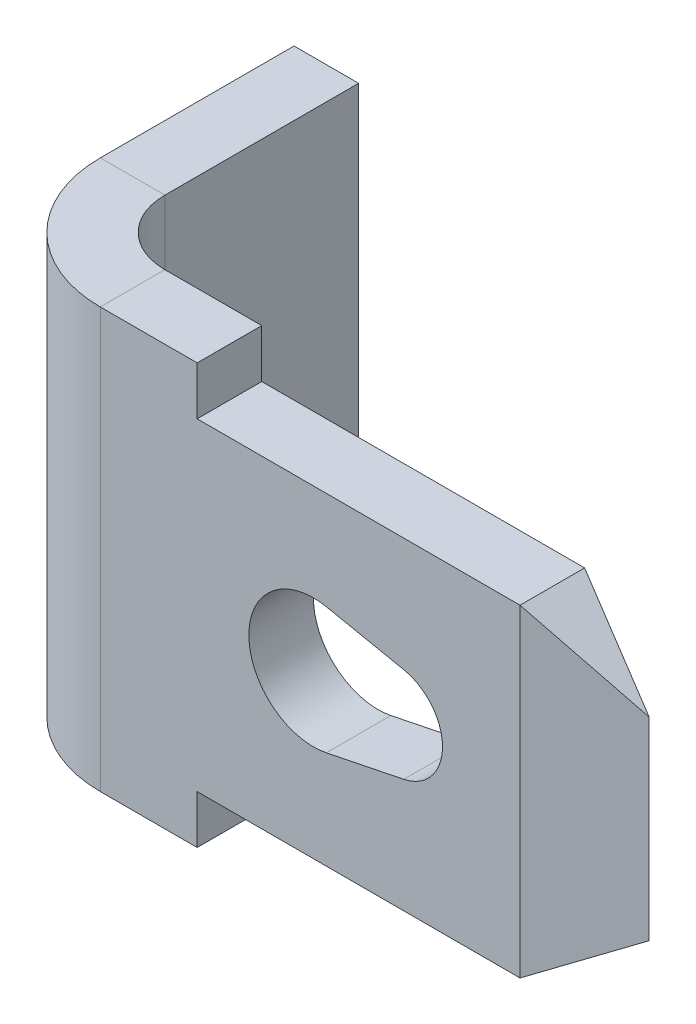
ISO-10303-21;
HEADER;
FILE_DESCRIPTION(('STEP AP214'),'2;1');
FILE_NAME('part.step','',(''),(''),'','','');
FILE_SCHEMA(('AUTOMOTIVE_DESIGN { 1 0 10303 214 1 1 1 1 }'));
ENDSEC;
DATA;
#1=APPLICATION_CONTEXT('core data for automotive mechanical design processes');
#2=APPLICATION_PROTOCOL_DEFINITION('international standard','automotive_design',2000,#1);
#3=PRODUCT_CONTEXT('',#1,'mechanical');
#4=PRODUCT('Part','Part','',(#3));
#5=PRODUCT_RELATED_PRODUCT_CATEGORY('part','',(#4));
#6=PRODUCT_DEFINITION_FORMATION('','',#4);
#7=PRODUCT_DEFINITION_CONTEXT('part definition',#1,'design');
#8=PRODUCT_DEFINITION('design','',#6,#7);
#9=PRODUCT_DEFINITION_SHAPE('','',#8);
#10=(LENGTH_UNIT() NAMED_UNIT(*) SI_UNIT(.MILLI.,.METRE.));
#11=(NAMED_UNIT(*) PLANE_ANGLE_UNIT() SI_UNIT($,.RADIAN.));
#12=(NAMED_UNIT(*) SI_UNIT($,.STERADIAN.) SOLID_ANGLE_UNIT());
#13=UNCERTAINTY_MEASURE_WITH_UNIT(LENGTH_MEASURE(1.E-05),#10,'distance_accuracy_value','');
#14=(GEOMETRIC_REPRESENTATION_CONTEXT(3) GLOBAL_UNCERTAINTY_ASSIGNED_CONTEXT((#13)) GLOBAL_UNIT_ASSIGNED_CONTEXT((#10,
#11,#12)) REPRESENTATION_CONTEXT('',''));
#15=CARTESIAN_POINT('',(0.,0.,0.));
#16=DIRECTION('',(0.,0.,1.));
#17=DIRECTION('',(1.,0.,0.));
#18=AXIS2_PLACEMENT_3D('',#15,#16,#17);
#19=CARTESIAN_POINT('',(7.55,0.,0.));
#20=DIRECTION('',(0.,0.,-1.));
#21=DIRECTION('',(-1.,0.,0.));
#22=AXIS2_PLACEMENT_3D('',#19,#20,#21);
#23=CYLINDRICAL_SURFACE('',#22,0.75);
#24=DIRECTION('',(0.,0.,-1.));
#25=VECTOR('',#24,1.);
#26=CARTESIAN_POINT('',(7.7,-0.734846922834954,0.));
#27=LINE('',#26,#25);
#28=CARTESIAN_POINT('',(7.7,-0.734846922834953,1.));
#29=VERTEX_POINT('',#28);
#30=CARTESIAN_POINT('',(7.7,-0.734846922834954,0.));
#31=VERTEX_POINT('',#30);
#32=EDGE_CURVE('E12',#29,#31,#27,.T.);
#33=ORIENTED_EDGE('',*,*,#32,.F.);
#34=CARTESIAN_POINT('',(7.55,0.,0.999999999999999));
#35=DIRECTION('',(0.,0.,-1.));
#36=DIRECTION('',(-1.,0.,0.));
#37=AXIS2_PLACEMENT_3D('',#34,#35,#36);
#38=CIRCLE('',#37,0.75);
#39=CARTESIAN_POINT('',(7.7,0.734846922834953,1.));
#40=VERTEX_POINT('',#39);
#41=EDGE_CURVE('E146',#29,#40,#38,.F.);
#42=ORIENTED_EDGE('',*,*,#41,.T.);
#43=DIRECTION('',(0.,0.,-1.));
#44=VECTOR('',#43,1.);
#45=CARTESIAN_POINT('',(7.7,0.734846922834953,0.));
#46=LINE('',#45,#44);
#47=CARTESIAN_POINT('',(7.7,0.734846922834953,0.));
#48=VERTEX_POINT('',#47);
#49=EDGE_CURVE('E67',#40,#48,#46,.T.);
#50=ORIENTED_EDGE('',*,*,#49,.T.);
#51=CARTESIAN_POINT('',(7.55,0.,0.));
#52=DIRECTION('',(0.,0.,-1.));
#53=DIRECTION('',(-1.,0.,0.));
#54=AXIS2_PLACEMENT_3D('',#51,#52,#53);
#55=CIRCLE('',#54,0.75);
#56=EDGE_CURVE('E201',#31,#48,#55,.F.);
#57=ORIENTED_EDGE('',*,*,#56,.F.);
#58=EDGE_LOOP('',(#33,#42,#50,#57));
#59=FACE_BOUND('',#58,.T.);
#60=ADVANCED_FACE('F57',(#59),#23,.F.);
#61=CARTESIAN_POINT('',(6.5,0.979795897113271,0.));
#62=DIRECTION('',(-0.2,-0.979795897113271,0.));
#63=DIRECTION('',(-0.979795897113271,0.2,0.));
#64=AXIS2_PLACEMENT_3D('',#61,#62,#63);
#65=PLANE('',#64);
#66=ORIENTED_EDGE('',*,*,#49,.F.);
#67=DIRECTION('',(-0.979795897113271,0.2,0.));
#68=VECTOR('',#67,1.);
#69=CARTESIAN_POINT('',(6.5,0.979795897113271,0.999999999999999));
#70=LINE('',#69,#68);
#71=CARTESIAN_POINT('',(6.5,0.97979589711327,1.));
#72=VERTEX_POINT('',#71);
#73=EDGE_CURVE('E159',#40,#72,#70,.T.);
#74=ORIENTED_EDGE('',*,*,#73,.T.);
#75=DIRECTION('',(0.,0.,-1.));
#76=VECTOR('',#75,1.);
#77=CARTESIAN_POINT('',(6.5,0.979795897113271,0.));
#78=LINE('',#77,#76);
#79=CARTESIAN_POINT('',(6.5,0.979795897113271,0.));
#80=VERTEX_POINT('',#79);
#81=EDGE_CURVE('E138',#72,#80,#78,.T.);
#82=ORIENTED_EDGE('',*,*,#81,.T.);
#83=DIRECTION('',(-0.979795897113271,0.2,0.));
#84=VECTOR('',#83,1.);
#85=CARTESIAN_POINT('',(6.5,0.979795897113271,0.));
#86=LINE('',#85,#84);
#87=EDGE_CURVE('E209',#48,#80,#86,.T.);
#88=ORIENTED_EDGE('',*,*,#87,.F.);
#89=EDGE_LOOP('',(#66,#74,#82,#88));
#90=FACE_BOUND('',#89,.T.);
#91=ADVANCED_FACE('F211',(#90),#65,.T.);
#92=CARTESIAN_POINT('',(6.3,0.,0.));
#93=DIRECTION('',(0.,0.,-1.));
#94=DIRECTION('',(-1.,0.,0.));
#95=AXIS2_PLACEMENT_3D('',#92,#93,#94);
#96=CYLINDRICAL_SURFACE('',#95,1.);
#97=ORIENTED_EDGE('',*,*,#81,.F.);
#98=CARTESIAN_POINT('',(6.3,0.,0.999999999999999));
#99=DIRECTION('',(0.,0.,-1.));
#100=DIRECTION('',(-1.,0.,0.));
#101=AXIS2_PLACEMENT_3D('',#98,#99,#100);
#102=CIRCLE('',#101,1.);
#103=CARTESIAN_POINT('',(6.5,-0.979795897113271,1.));
#104=VERTEX_POINT('',#103);
#105=EDGE_CURVE('E144',#72,#104,#102,.F.);
#106=ORIENTED_EDGE('',*,*,#105,.T.);
#107=DIRECTION('',(0.,0.,-1.));
#108=VECTOR('',#107,1.);
#109=CARTESIAN_POINT('',(6.5,-0.979795897113272,0.));
#110=LINE('',#109,#108);
#111=CARTESIAN_POINT('',(6.5,-0.979795897113272,0.));
#112=VERTEX_POINT('',#111);
#113=EDGE_CURVE('E61',#104,#112,#110,.T.);
#114=ORIENTED_EDGE('',*,*,#113,.T.);
#115=CARTESIAN_POINT('',(6.3,0.,0.));
#116=DIRECTION('',(0.,0.,-1.));
#117=DIRECTION('',(-1.,0.,0.));
#118=AXIS2_PLACEMENT_3D('',#115,#116,#117);
#119=CIRCLE('',#118,1.);
#120=EDGE_CURVE('E309',#80,#112,#119,.F.);
#121=ORIENTED_EDGE('',*,*,#120,.F.);
#122=EDGE_LOOP('',(#97,#106,#114,#121));
#123=FACE_BOUND('',#122,.T.);
#124=ADVANCED_FACE('F148',(#123),#96,.F.);
#125=CARTESIAN_POINT('',(2.,-3.25,-4.));
#126=DIRECTION('',(0.,-1.,0.));
#127=DIRECTION('',(0.,0.,1.));
#128=AXIS2_PLACEMENT_3D('',#125,#126,#127);
#129=PLANE('',#128);
#130=DIRECTION('',(1.,0.,0.));
#131=VECTOR('',#130,1.);
#132=CARTESIAN_POINT('',(2.,-3.25,-1.));
#133=LINE('',#132,#131);
#134=CARTESIAN_POINT('',(0.999999999999999,-3.25,-1.));
#135=VERTEX_POINT('',#134);
#136=CARTESIAN_POINT('',(2.,-3.25,-1.));
#137=VERTEX_POINT('',#136);
#138=EDGE_CURVE('E139',#135,#137,#133,.T.);
#139=ORIENTED_EDGE('',*,*,#138,.F.);
#140=DIRECTION('',(0.,0.,1.));
#141=VECTOR('',#140,1.);
#142=CARTESIAN_POINT('',(0.999999999999999,-3.25,-4.));
#143=LINE('',#142,#141);
#144=CARTESIAN_POINT('',(0.999999999999999,-3.25,-4.));
#145=VERTEX_POINT('',#144);
#146=EDGE_CURVE('E250',#145,#135,#143,.T.);
#147=ORIENTED_EDGE('',*,*,#146,.F.);
#148=DIRECTION('',(1.,0.,0.));
#149=VECTOR('',#148,1.);
#150=CARTESIAN_POINT('',(2.,-3.25,-4.));
#151=LINE('',#150,#149);
#152=CARTESIAN_POINT('',(2.,-3.25,-4.));
#153=VERTEX_POINT('',#152);
#154=EDGE_CURVE('E189',#145,#153,#151,.T.);
#155=ORIENTED_EDGE('',*,*,#154,.T.);
#156=DIRECTION('',(0.,0.,1.));
#157=VECTOR('',#156,1.);
#158=CARTESIAN_POINT('',(2.,-3.25,-4.));
#159=LINE('',#158,#157);
#160=EDGE_CURVE('E227',#153,#137,#159,.T.);
#161=ORIENTED_EDGE('',*,*,#160,.T.);
#162=EDGE_LOOP('',(#139,#147,#155,#161));
#163=FACE_BOUND('',#162,.T.);
#164=ADVANCED_FACE('F331',(#163),#129,.T.);
#165=CARTESIAN_POINT('',(2.,-3.25,-4.));
#166=DIRECTION('',(0.,0.,-1.));
#167=DIRECTION('',(0.,-1.,0.));
#168=AXIS2_PLACEMENT_3D('',#165,#166,#167);
#169=PLANE('',#168);
#170=ORIENTED_EDGE('',*,*,#154,.F.);
#171=DIRECTION('',(0.,1.,0.));
#172=VECTOR('',#171,1.);
#173=CARTESIAN_POINT('',(0.999999999999999,-3.25,-4.));
#174=LINE('',#173,#172);
#175=CARTESIAN_POINT('',(0.999999999999999,3.25,-4.));
#176=VERTEX_POINT('',#175);
#177=EDGE_CURVE('E253',#176,#145,#174,.F.);
#178=ORIENTED_EDGE('',*,*,#177,.F.);
#179=DIRECTION('',(1.,0.,0.));
#180=VECTOR('',#179,1.);
#181=CARTESIAN_POINT('',(2.,3.25,-4.));
#182=LINE('',#181,#180);
#183=CARTESIAN_POINT('',(2.,3.25,-4.));
#184=VERTEX_POINT('',#183);
#185=EDGE_CURVE('E186',#176,#184,#182,.T.);
#186=ORIENTED_EDGE('',*,*,#185,.T.);
#187=DIRECTION('',(0.,-1.,0.));
#188=VECTOR('',#187,1.);
#189=CARTESIAN_POINT('',(2.,-3.25,-4.));
#190=LINE('',#189,#188);
#191=EDGE_CURVE('E286',#184,#153,#190,.T.);
#192=ORIENTED_EDGE('',*,*,#191,.T.);
#193=EDGE_LOOP('',(#170,#178,#186,#192));
#194=FACE_BOUND('',#193,.T.);
#195=ADVANCED_FACE('F334',(#194),#169,.T.);
#196=CARTESIAN_POINT('',(2.,3.25,-4.));
#197=DIRECTION('',(0.,-1.,0.));
#198=DIRECTION('',(0.,0.,1.));
#199=AXIS2_PLACEMENT_3D('',#196,#197,#198);
#200=PLANE('',#199);
#201=ORIENTED_EDGE('',*,*,#185,.F.);
#202=DIRECTION('',(0.,0.,1.));
#203=VECTOR('',#202,1.);
#204=CARTESIAN_POINT('',(0.999999999999999,3.25,-4.));
#205=LINE('',#204,#203);
#206=CARTESIAN_POINT('',(0.999999999999999,3.25,-1.));
#207=VERTEX_POINT('',#206);
#208=EDGE_CURVE('E246',#176,#207,#205,.T.);
#209=ORIENTED_EDGE('',*,*,#208,.T.);
#210=DIRECTION('',(1.,0.,0.));
#211=VECTOR('',#210,1.);
#212=CARTESIAN_POINT('',(2.,3.25,-1.));
#213=LINE('',#212,#211);
#214=CARTESIAN_POINT('',(2.,3.25,-1.));
#215=VERTEX_POINT('',#214);
#216=EDGE_CURVE('E183',#207,#215,#213,.T.);
#217=ORIENTED_EDGE('',*,*,#216,.T.);
#218=DIRECTION('',(0.,0.,1.));
#219=VECTOR('',#218,1.);
#220=CARTESIAN_POINT('',(2.,3.25,-4.));
#221=LINE('',#220,#219);
#222=EDGE_CURVE('E289',#184,#215,#221,.T.);
#223=ORIENTED_EDGE('',*,*,#222,.F.);
#224=EDGE_LOOP('',(#201,#209,#217,#223));
#225=FACE_BOUND('',#224,.T.);
#226=ADVANCED_FACE('F317',(#225),#200,.F.);
#227=CARTESIAN_POINT('',(3.,3.25,-1.));
#228=DIRECTION('',(0.,-1.,0.));
#229=DIRECTION('',(0.,0.,-1.));
#230=AXIS2_PLACEMENT_3D('',#227,#228,#229);
#231=PLANE('',#230);
#232=ORIENTED_EDGE('',*,*,#216,.F.);
#233=CARTESIAN_POINT('',(3.,3.25,-1.));
#234=DIRECTION('',(0.,-1.,0.));
#235=DIRECTION('',(0.,0.,-1.));
#236=AXIS2_PLACEMENT_3D('',#233,#234,#235);
#237=CIRCLE('',#236,2.);
#238=CARTESIAN_POINT('',(3.,3.25,1.));
#239=VERTEX_POINT('',#238);
#240=EDGE_CURVE('E247',#207,#239,#237,.F.);
#241=ORIENTED_EDGE('',*,*,#240,.T.);
#242=DIRECTION('',(0.,0.,-1.));
#243=VECTOR('',#242,1.);
#244=CARTESIAN_POINT('',(3.,3.25,0.));
#245=LINE('',#244,#243);
#246=CARTESIAN_POINT('',(3.,3.25,0.));
#247=VERTEX_POINT('',#246);
#248=EDGE_CURVE('E181',#239,#247,#245,.T.);
#249=ORIENTED_EDGE('',*,*,#248,.T.);
#250=CARTESIAN_POINT('',(3.,3.25,-1.));
#251=DIRECTION('',(0.,1.,0.));
#252=DIRECTION('',(0.,0.,1.));
#253=AXIS2_PLACEMENT_3D('',#250,#251,#252);
#254=CIRCLE('',#253,1.);
#255=EDGE_CURVE('E223',#215,#247,#254,.T.);
#256=ORIENTED_EDGE('',*,*,#255,.F.);
#257=EDGE_LOOP('',(#232,#241,#249,#256));
#258=FACE_BOUND('',#257,.T.);
#259=ADVANCED_FACE('F326',(#258),#231,.F.);
#260=CARTESIAN_POINT('',(0.,3.25,0.));
#261=DIRECTION('',(0.,-1.,0.));
#262=DIRECTION('',(-1.,0.,0.));
#263=AXIS2_PLACEMENT_3D('',#260,#261,#262);
#264=PLANE('',#263);
#265=ORIENTED_EDGE('',*,*,#248,.F.);
#266=DIRECTION('',(-1.,0.,0.));
#267=VECTOR('',#266,1.);
#268=CARTESIAN_POINT('',(0.,3.25,1.));
#269=LINE('',#268,#267);
#270=CARTESIAN_POINT('',(4.5,3.25,1.));
#271=VERTEX_POINT('',#270);
#272=EDGE_CURVE('E243',#271,#239,#269,.T.);
#273=ORIENTED_EDGE('',*,*,#272,.F.);
#274=DIRECTION('',(0.,0.,-1.));
#275=VECTOR('',#274,1.);
#276=CARTESIAN_POINT('',(4.5,3.25,0.));
#277=LINE('',#276,#275);
#278=CARTESIAN_POINT('',(4.5,3.25,0.));
#279=VERTEX_POINT('',#278);
#280=EDGE_CURVE('E178',#271,#279,#277,.T.);
#281=ORIENTED_EDGE('',*,*,#280,.T.);
#282=DIRECTION('',(-1.,0.,0.));
#283=VECTOR('',#282,1.);
#284=CARTESIAN_POINT('',(0.,3.25,0.));
#285=LINE('',#284,#283);
#286=EDGE_CURVE('E292',#279,#247,#285,.T.);
#287=ORIENTED_EDGE('',*,*,#286,.T.);
#288=EDGE_LOOP('',(#265,#273,#281,#287));
#289=FACE_BOUND('',#288,.T.);
#290=ADVANCED_FACE('F380',(#289),#264,.F.);
#291=CARTESIAN_POINT('',(4.5,3.25,0.));
#292=DIRECTION('',(-1.,0.,0.));
#293=DIRECTION('',(0.,1.,0.));
#294=AXIS2_PLACEMENT_3D('',#291,#292,#293);
#295=PLANE('',#294);
#296=ORIENTED_EDGE('',*,*,#280,.F.);
#297=DIRECTION('',(0.,1.,0.));
#298=VECTOR('',#297,1.);
#299=CARTESIAN_POINT('',(4.5,0.,1.));
#300=LINE('',#299,#298);
#301=CARTESIAN_POINT('',(4.5,2.5,1.));
#302=VERTEX_POINT('',#301);
#303=EDGE_CURVE('E240',#302,#271,#300,.T.);
#304=ORIENTED_EDGE('',*,*,#303,.F.);
#305=DIRECTION('',(0.,0.,-1.));
#306=VECTOR('',#305,1.);
#307=CARTESIAN_POINT('',(4.5,2.5,0.));
#308=LINE('',#307,#306);
#309=CARTESIAN_POINT('',(4.5,2.5,0.));
#310=VERTEX_POINT('',#309);
#311=EDGE_CURVE('E175',#302,#310,#308,.T.);
#312=ORIENTED_EDGE('',*,*,#311,.T.);
#313=DIRECTION('',(0.,1.,0.));
#314=VECTOR('',#313,1.);
#315=CARTESIAN_POINT('',(4.5,3.25,0.));
#316=LINE('',#315,#314);
#317=EDGE_CURVE('E295',#310,#279,#316,.T.);
#318=ORIENTED_EDGE('',*,*,#317,.T.);
#319=EDGE_LOOP('',(#296,#304,#312,#318));
#320=FACE_BOUND('',#319,.T.);
#321=ADVANCED_FACE('F383',(#320),#295,.F.);
#322=CARTESIAN_POINT('',(4.5,2.5,0.));
#323=DIRECTION('',(0.,-1.,0.));
#324=DIRECTION('',(-1.,0.,0.));
#325=AXIS2_PLACEMENT_3D('',#322,#323,#324);
#326=PLANE('',#325);
#327=ORIENTED_EDGE('',*,*,#311,.F.);
#328=DIRECTION('',(-1.,0.,0.));
#329=VECTOR('',#328,1.);
#330=CARTESIAN_POINT('',(0.,2.5,1.));
#331=LINE('',#330,#329);
#332=CARTESIAN_POINT('',(9.5,2.5,1.));
#333=VERTEX_POINT('',#332);
#334=EDGE_CURVE('E237',#333,#302,#331,.T.);
#335=ORIENTED_EDGE('',*,*,#334,.F.);
#336=DIRECTION('',(0.,0.,-1.));
#337=VECTOR('',#336,1.);
#338=CARTESIAN_POINT('',(9.5,2.5,0.));
#339=LINE('',#338,#337);
#340=CARTESIAN_POINT('',(9.5,2.5,0.));
#341=VERTEX_POINT('',#340);
#342=EDGE_CURVE('E172',#333,#341,#339,.T.);
#343=ORIENTED_EDGE('',*,*,#342,.T.);
#344=DIRECTION('',(-1.,0.,0.));
#345=VECTOR('',#344,1.);
#346=CARTESIAN_POINT('',(4.5,2.5,0.));
#347=LINE('',#346,#345);
#348=EDGE_CURVE('E298',#341,#310,#347,.T.);
#349=ORIENTED_EDGE('',*,*,#348,.T.);
#350=EDGE_LOOP('',(#327,#335,#343,#349));
#351=FACE_BOUND('',#350,.T.);
#352=ADVANCED_FACE('F387',(#351),#326,.F.);
#353=CARTESIAN_POINT('',(9.5,2.5,0.));
#354=DIRECTION('',(-0.554700196225229,-0.832050294337844,0.));
#355=DIRECTION('',(-0.832050294337844,0.554700196225229,0.));
#356=AXIS2_PLACEMENT_3D('',#353,#354,#355);
#357=PLANE('',#356);
#358=DIRECTION('',(-0.801783725737273,0.534522483824849,0.267261241912424));
#359=VECTOR('',#358,1.);
#360=CARTESIAN_POINT('',(3.28528571428572,6.64314285714286,3.07157142857143));
#361=LINE('',#360,#359);
#362=CARTESIAN_POINT('',(11.,1.5,0.500000000000001));
#363=VERTEX_POINT('',#362);
#364=EDGE_CURVE('E446',#333,#363,#361,.F.);
#365=ORIENTED_EDGE('',*,*,#364,.T.);
#366=DIRECTION('',(0.801783725737273,-0.534522483824849,0.267261241912424));
#367=VECTOR('',#366,1.);
#368=CARTESIAN_POINT('',(3.071,6.786,-2.143));
#369=LINE('',#368,#367);
#370=EDGE_CURVE('E271',#363,#341,#369,.F.);
#371=ORIENTED_EDGE('',*,*,#370,.T.);
#372=ORIENTED_EDGE('',*,*,#342,.F.);
#373=EDGE_LOOP('',(#365,#371,#372));
#374=FACE_BOUND('',#373,.T.);
#375=ADVANCED_FACE('F391',(#374),#357,.F.);
#376=CARTESIAN_POINT('',(9.5,-2.5,0.));
#377=DIRECTION('',(-0.554700196225229,0.832050294337844,0.));
#378=DIRECTION('',(0.832050294337844,0.554700196225229,0.));
#379=AXIS2_PLACEMENT_3D('',#376,#377,#378);
#380=PLANE('',#379);
#381=DIRECTION('',(0.801783725737273,0.534522483824849,-0.267261241912424));
#382=VECTOR('',#381,1.);
#383=CARTESIAN_POINT('',(6.07185714285714,-4.78542857142857,2.14271428571429));
#384=LINE('',#383,#382);
#385=CARTESIAN_POINT('',(11.,-1.5,0.5));
#386=VERTEX_POINT('',#385);
#387=CARTESIAN_POINT('',(9.5,-2.5,1.));
#388=VERTEX_POINT('',#387);
#389=EDGE_CURVE('E444',#386,#388,#384,.F.);
#390=ORIENTED_EDGE('',*,*,#389,.T.);
#391=DIRECTION('',(0.,0.,-1.));
#392=VECTOR('',#391,1.);
#393=CARTESIAN_POINT('',(9.5,-2.5,0.));
#394=LINE('',#393,#392);
#395=CARTESIAN_POINT('',(9.5,-2.5,0.));
#396=VERTEX_POINT('',#395);
#397=EDGE_CURVE('E169',#388,#396,#394,.T.);
#398=ORIENTED_EDGE('',*,*,#397,.T.);
#399=DIRECTION('',(-0.801783725737273,-0.534522483824849,-0.267261241912424));
#400=VECTOR('',#399,1.);
#401=CARTESIAN_POINT('',(5.85757142857143,-4.92828571428571,-1.21414285714286));
#402=LINE('',#401,#400);
#403=EDGE_CURVE('E447',#396,#386,#402,.F.);
#404=ORIENTED_EDGE('',*,*,#403,.T.);
#405=EDGE_LOOP('',(#390,#398,#404));
#406=FACE_BOUND('',#405,.T.);
#407=ADVANCED_FACE('F395',(#406),#380,.F.);
#408=CARTESIAN_POINT('',(4.5,-2.5,0.));
#409=DIRECTION('',(0.,1.,0.));
#410=DIRECTION('',(1.,0.,0.));
#411=AXIS2_PLACEMENT_3D('',#408,#409,#410);
#412=PLANE('',#411);
#413=ORIENTED_EDGE('',*,*,#397,.F.);
#414=DIRECTION('',(-1.,0.,0.));
#415=VECTOR('',#414,1.);
#416=CARTESIAN_POINT('',(0.,-2.5,1.));
#417=LINE('',#416,#415);
#418=CARTESIAN_POINT('',(4.5,-2.5,1.));
#419=VERTEX_POINT('',#418);
#420=EDGE_CURVE('E234',#419,#388,#417,.F.);
#421=ORIENTED_EDGE('',*,*,#420,.F.);
#422=DIRECTION('',(0.,0.,-1.));
#423=VECTOR('',#422,1.);
#424=CARTESIAN_POINT('',(4.5,-2.5,0.));
#425=LINE('',#424,#423);
#426=CARTESIAN_POINT('',(4.5,-2.5,0.));
#427=VERTEX_POINT('',#426);
#428=EDGE_CURVE('E166',#419,#427,#425,.T.);
#429=ORIENTED_EDGE('',*,*,#428,.T.);
#430=DIRECTION('',(1.,0.,0.));
#431=VECTOR('',#430,1.);
#432=CARTESIAN_POINT('',(4.5,-2.5,0.));
#433=LINE('',#432,#431);
#434=EDGE_CURVE('E301',#427,#396,#433,.T.);
#435=ORIENTED_EDGE('',*,*,#434,.T.);
#436=EDGE_LOOP('',(#413,#421,#429,#435));
#437=FACE_BOUND('',#436,.T.);
#438=ADVANCED_FACE('F361',(#437),#412,.F.);
#439=CARTESIAN_POINT('',(4.5,-3.25,0.));
#440=DIRECTION('',(-1.,0.,0.));
#441=DIRECTION('',(0.,1.,0.));
#442=AXIS2_PLACEMENT_3D('',#439,#440,#441);
#443=PLANE('',#442);
#444=ORIENTED_EDGE('',*,*,#428,.F.);
#445=DIRECTION('',(0.,1.,0.));
#446=VECTOR('',#445,1.);
#447=CARTESIAN_POINT('',(4.5,0.,1.));
#448=LINE('',#447,#446);
#449=CARTESIAN_POINT('',(4.5,-3.25,1.));
#450=VERTEX_POINT('',#449);
#451=EDGE_CURVE('E153',#450,#419,#448,.T.);
#452=ORIENTED_EDGE('',*,*,#451,.F.);
#453=DIRECTION('',(0.,0.,-1.));
#454=VECTOR('',#453,1.);
#455=CARTESIAN_POINT('',(4.5,-3.25,0.));
#456=LINE('',#455,#454);
#457=CARTESIAN_POINT('',(4.5,-3.25,0.));
#458=VERTEX_POINT('',#457);
#459=EDGE_CURVE('E163',#450,#458,#456,.T.);
#460=ORIENTED_EDGE('',*,*,#459,.T.);
#461=DIRECTION('',(0.,1.,0.));
#462=VECTOR('',#461,1.);
#463=CARTESIAN_POINT('',(4.5,-3.25,0.));
#464=LINE('',#463,#462);
#465=EDGE_CURVE('E304',#458,#427,#464,.T.);
#466=ORIENTED_EDGE('',*,*,#465,.T.);
#467=EDGE_LOOP('',(#444,#452,#460,#466));
#468=FACE_BOUND('',#467,.T.);
#469=ADVANCED_FACE('F350',(#468),#443,.F.);
#470=CARTESIAN_POINT('',(0.,-3.25,0.));
#471=DIRECTION('',(0.,1.,0.));
#472=DIRECTION('',(1.,0.,0.));
#473=AXIS2_PLACEMENT_3D('',#470,#471,#472);
#474=PLANE('',#473);
#475=ORIENTED_EDGE('',*,*,#459,.F.);
#476=DIRECTION('',(-1.,0.,0.));
#477=VECTOR('',#476,1.);
#478=CARTESIAN_POINT('',(0.,-3.25,1.));
#479=LINE('',#478,#477);
#480=CARTESIAN_POINT('',(3.,-3.25,1.));
#481=VERTEX_POINT('',#480);
#482=EDGE_CURVE('E150',#481,#450,#479,.F.);
#483=ORIENTED_EDGE('',*,*,#482,.F.);
#484=DIRECTION('',(0.,0.,-1.));
#485=VECTOR('',#484,1.);
#486=CARTESIAN_POINT('',(3.,-3.25,0.));
#487=LINE('',#486,#485);
#488=CARTESIAN_POINT('',(3.,-3.25,0.));
#489=VERTEX_POINT('',#488);
#490=EDGE_CURVE('E75',#481,#489,#487,.T.);
#491=ORIENTED_EDGE('',*,*,#490,.T.);
#492=DIRECTION('',(1.,0.,0.));
#493=VECTOR('',#492,1.);
#494=CARTESIAN_POINT('',(0.,-3.25,0.));
#495=LINE('',#494,#493);
#496=EDGE_CURVE('E307',#489,#458,#495,.T.);
#497=ORIENTED_EDGE('',*,*,#496,.T.);
#498=EDGE_LOOP('',(#475,#483,#491,#497));
#499=FACE_BOUND('',#498,.T.);
#500=ADVANCED_FACE('F353',(#499),#474,.F.);
#501=CARTESIAN_POINT('',(3.,-3.25,-1.));
#502=DIRECTION('',(0.,-1.,0.));
#503=DIRECTION('',(0.,0.,-1.));
#504=AXIS2_PLACEMENT_3D('',#501,#502,#503);
#505=PLANE('',#504);
#506=CARTESIAN_POINT('',(3.,-3.25,-1.));
#507=DIRECTION('',(0.,-1.,0.));
#508=DIRECTION('',(0.,0.,-1.));
#509=AXIS2_PLACEMENT_3D('',#506,#507,#508);
#510=CIRCLE('',#509,2.);
#511=EDGE_CURVE('E157',#481,#135,#510,.T.);
#512=ORIENTED_EDGE('',*,*,#511,.T.);
#513=ORIENTED_EDGE('',*,*,#138,.T.);
#514=CARTESIAN_POINT('',(3.,-3.25,-1.));
#515=DIRECTION('',(0.,1.,0.));
#516=DIRECTION('',(0.,0.,1.));
#517=AXIS2_PLACEMENT_3D('',#514,#515,#516);
#518=CIRCLE('',#517,1.);
#519=EDGE_CURVE('E220',#489,#137,#518,.F.);
#520=ORIENTED_EDGE('',*,*,#519,.F.);
#521=ORIENTED_EDGE('',*,*,#490,.F.);
#522=EDGE_LOOP('',(#512,#513,#520,#521));
#523=FACE_BOUND('',#522,.T.);
#524=ADVANCED_FACE('F267',(#523),#505,.T.);
#525=CARTESIAN_POINT('',(6.5,-0.979795897113272,0.));
#526=DIRECTION('',(-0.2,0.979795897113271,0.));
#527=DIRECTION('',(0.979795897113271,0.2,0.));
#528=AXIS2_PLACEMENT_3D('',#525,#526,#527);
#529=PLANE('',#528);
#530=DIRECTION('',(0.979795897113271,0.2,0.));
#531=VECTOR('',#530,1.);
#532=CARTESIAN_POINT('',(6.5,-0.979795897113272,0.999999999999999));
#533=LINE('',#532,#531);
#534=EDGE_CURVE('E130',#104,#29,#533,.T.);
#535=ORIENTED_EDGE('',*,*,#534,.T.);
#536=ORIENTED_EDGE('',*,*,#32,.T.);
#537=DIRECTION('',(0.979795897113271,0.2,0.));
#538=VECTOR('',#537,1.);
#539=CARTESIAN_POINT('',(6.5,-0.979795897113272,0.));
#540=LINE('',#539,#538);
#541=EDGE_CURVE('E133',#112,#31,#540,.T.);
#542=ORIENTED_EDGE('',*,*,#541,.F.);
#543=ORIENTED_EDGE('',*,*,#113,.F.);
#544=EDGE_LOOP('',(#535,#536,#542,#543));
#545=FACE_BOUND('',#544,.T.);
#546=ADVANCED_FACE('F59',(#545),#529,.T.);
#547=CARTESIAN_POINT('',(0.,0.,0.));
#548=DIRECTION('',(0.,0.,-1.));
#549=DIRECTION('',(-1.,0.,0.));
#550=AXIS2_PLACEMENT_3D('',#547,#548,#549);
#551=PLANE('',#550);
#552=DIRECTION('',(0.,-1.,0.));
#553=VECTOR('',#552,1.);
#554=CARTESIAN_POINT('',(9.5,3.251,0.));
#555=LINE('',#554,#553);
#556=EDGE_CURVE('E273',#341,#396,#555,.T.);
#557=ORIENTED_EDGE('',*,*,#556,.T.);
#558=ORIENTED_EDGE('',*,*,#434,.F.);
#559=ORIENTED_EDGE('',*,*,#465,.F.);
#560=ORIENTED_EDGE('',*,*,#496,.F.);
#561=DIRECTION('',(0.,-1.,0.));
#562=VECTOR('',#561,1.);
#563=CARTESIAN_POINT('',(3.,0.,0.));
#564=LINE('',#563,#562);
#565=EDGE_CURVE('E195',#489,#247,#564,.F.);
#566=ORIENTED_EDGE('',*,*,#565,.T.);
#567=ORIENTED_EDGE('',*,*,#286,.F.);
#568=ORIENTED_EDGE('',*,*,#317,.F.);
#569=ORIENTED_EDGE('',*,*,#348,.F.);
#570=EDGE_LOOP('',(#557,#558,#559,#560,#566,#567,#568,#569));
#571=FACE_BOUND('',#570,.T.);
#572=ORIENTED_EDGE('',*,*,#120,.T.);
#573=ORIENTED_EDGE('',*,*,#541,.T.);
#574=ORIENTED_EDGE('',*,*,#56,.T.);
#575=ORIENTED_EDGE('',*,*,#87,.T.);
#576=EDGE_LOOP('',(#572,#573,#574,#575));
#577=FACE_BOUND('',#576,.T.);
#578=ADVANCED_FACE('F208',(#571,#577),#551,.T.);
#579=CARTESIAN_POINT('',(2.,-3.25,-4.));
#580=DIRECTION('',(-1.,0.,0.));
#581=DIRECTION('',(0.,0.,1.));
#582=AXIS2_PLACEMENT_3D('',#579,#580,#581);
#583=PLANE('',#582);
#584=ORIENTED_EDGE('',*,*,#222,.T.);
#585=DIRECTION('',(0.,-1.,0.));
#586=VECTOR('',#585,1.);
#587=CARTESIAN_POINT('',(2.,-3.25,-1.));
#588=LINE('',#587,#586);
#589=EDGE_CURVE('E212',#215,#137,#588,.T.);
#590=ORIENTED_EDGE('',*,*,#589,.T.);
#591=ORIENTED_EDGE('',*,*,#160,.F.);
#592=ORIENTED_EDGE('',*,*,#191,.F.);
#593=EDGE_LOOP('',(#584,#590,#591,#592));
#594=FACE_BOUND('',#593,.T.);
#595=ADVANCED_FACE('F323',(#594),#583,.F.);
#596=CARTESIAN_POINT('',(3.,-3.25,-1.));
#597=DIRECTION('',(0.,-1.,0.));
#598=DIRECTION('',(0.,0.,-1.));
#599=AXIS2_PLACEMENT_3D('',#596,#597,#598);
#600=CYLINDRICAL_SURFACE('',#599,1.);
#601=ORIENTED_EDGE('',*,*,#255,.T.);
#602=ORIENTED_EDGE('',*,*,#565,.F.);
#603=ORIENTED_EDGE('',*,*,#519,.T.);
#604=ORIENTED_EDGE('',*,*,#589,.F.);
#605=EDGE_LOOP('',(#601,#602,#603,#604));
#606=FACE_BOUND('',#605,.T.);
#607=ADVANCED_FACE('F329',(#606),#600,.F.);
#608=CARTESIAN_POINT('',(0.,0.,1.));
#609=DIRECTION('',(0.,0.,-1.));
#610=DIRECTION('',(-1.,0.,0.));
#611=AXIS2_PLACEMENT_3D('',#608,#609,#610);
#612=PLANE('',#611);
#613=ORIENTED_EDGE('',*,*,#420,.T.);
#614=DIRECTION('',(0.,-1.,0.));
#615=VECTOR('',#614,1.);
#616=CARTESIAN_POINT('',(9.5,3.251,1.));
#617=LINE('',#616,#615);
#618=EDGE_CURVE('E415',#333,#388,#617,.T.);
#619=ORIENTED_EDGE('',*,*,#618,.F.);
#620=ORIENTED_EDGE('',*,*,#334,.T.);
#621=ORIENTED_EDGE('',*,*,#303,.T.);
#622=ORIENTED_EDGE('',*,*,#272,.T.);
#623=DIRECTION('',(0.,1.,0.));
#624=VECTOR('',#623,1.);
#625=CARTESIAN_POINT('',(3.,0.,1.));
#626=LINE('',#625,#624);
#627=EDGE_CURVE('E224',#481,#239,#626,.T.);
#628=ORIENTED_EDGE('',*,*,#627,.F.);
#629=ORIENTED_EDGE('',*,*,#482,.T.);
#630=ORIENTED_EDGE('',*,*,#451,.T.);
#631=EDGE_LOOP('',(#613,#619,#620,#621,#622,#628,#629,#630));
#632=FACE_BOUND('',#631,.T.);
#633=ORIENTED_EDGE('',*,*,#105,.F.);
#634=ORIENTED_EDGE('',*,*,#73,.F.);
#635=ORIENTED_EDGE('',*,*,#41,.F.);
#636=ORIENTED_EDGE('',*,*,#534,.F.);
#637=EDGE_LOOP('',(#633,#634,#635,#636));
#638=FACE_BOUND('',#637,.T.);
#639=ADVANCED_FACE('F142',(#632,#638),#612,.F.);
#640=CARTESIAN_POINT('',(0.999999999999999,-3.25,-4.));
#641=DIRECTION('',(-1.,0.,0.));
#642=DIRECTION('',(0.,0.,1.));
#643=AXIS2_PLACEMENT_3D('',#640,#641,#642);
#644=PLANE('',#643);
#645=ORIENTED_EDGE('',*,*,#208,.F.);
#646=ORIENTED_EDGE('',*,*,#177,.T.);
#647=ORIENTED_EDGE('',*,*,#146,.T.);
#648=DIRECTION('',(0.,1.,0.));
#649=VECTOR('',#648,1.);
#650=CARTESIAN_POINT('',(0.999999999999999,-3.25,-1.));
#651=LINE('',#650,#649);
#652=EDGE_CURVE('E161',#207,#135,#651,.F.);
#653=ORIENTED_EDGE('',*,*,#652,.F.);
#654=EDGE_LOOP('',(#645,#646,#647,#653));
#655=FACE_BOUND('',#654,.T.);
#656=ADVANCED_FACE('F261',(#655),#644,.T.);
#657=CARTESIAN_POINT('',(3.,-3.25,-1.));
#658=DIRECTION('',(0.,-1.,0.));
#659=DIRECTION('',(0.,0.,-1.));
#660=AXIS2_PLACEMENT_3D('',#657,#658,#659);
#661=CYLINDRICAL_SURFACE('',#660,2.);
#662=ORIENTED_EDGE('',*,*,#240,.F.);
#663=ORIENTED_EDGE('',*,*,#652,.T.);
#664=ORIENTED_EDGE('',*,*,#511,.F.);
#665=ORIENTED_EDGE('',*,*,#627,.T.);
#666=EDGE_LOOP('',(#662,#663,#664,#665));
#667=FACE_BOUND('',#666,.T.);
#668=ADVANCED_FACE('F417',(#667),#661,.T.);
#669=CARTESIAN_POINT('',(0.95,3.251,-2.85));
#670=DIRECTION('',(-0.316227766016838,0.,0.948683298050514));
#671=DIRECTION('',(0.948683298050514,0.,0.316227766016838));
#672=AXIS2_PLACEMENT_3D('',#669,#670,#671);
#673=PLANE('',#672);
#674=DIRECTION('',(0.,-1.,0.));
#675=VECTOR('',#674,1.);
#676=CARTESIAN_POINT('',(11.,3.251,0.5));
#677=LINE('',#676,#675);
#678=EDGE_CURVE('E280',#363,#386,#677,.T.);
#679=ORIENTED_EDGE('',*,*,#678,.T.);
#680=ORIENTED_EDGE('',*,*,#403,.F.);
#681=ORIENTED_EDGE('',*,*,#556,.F.);
#682=ORIENTED_EDGE('',*,*,#370,.F.);
#683=EDGE_LOOP('',(#679,#680,#681,#682));
#684=FACE_BOUND('',#683,.T.);
#685=ADVANCED_FACE('F419',(#684),#673,.F.);
#686=CARTESIAN_POINT('',(1.25,3.251,3.75));
#687=DIRECTION('',(-0.316227766016838,0.,-0.948683298050514));
#688=DIRECTION('',(-0.948683298050514,0.,0.316227766016838));
#689=AXIS2_PLACEMENT_3D('',#686,#687,#688);
#690=PLANE('',#689);
#691=ORIENTED_EDGE('',*,*,#618,.T.);
#692=ORIENTED_EDGE('',*,*,#389,.F.);
#693=ORIENTED_EDGE('',*,*,#678,.F.);
#694=ORIENTED_EDGE('',*,*,#364,.F.);
#695=EDGE_LOOP('',(#691,#692,#693,#694));
#696=FACE_BOUND('',#695,.T.);
#697=ADVANCED_FACE('F424',(#696),#690,.F.);
#698=CLOSED_SHELL('',(#60,#91,#124,#164,#195,#226,#259,#290,#321,#352,#375,#407,#438,#469,#500,
#524,#546,#578,#595,#607,#639,#656,#668,#685,#697));
#699=MANIFOLD_SOLID_BREP('B2',#698);
#700=ADVANCED_BREP_SHAPE_REPRESENTATION('',(#18,#699),#14);
#701=SHAPE_DEFINITION_REPRESENTATION(#9,#700);
ENDSEC;
END-ISO-10303-21;
